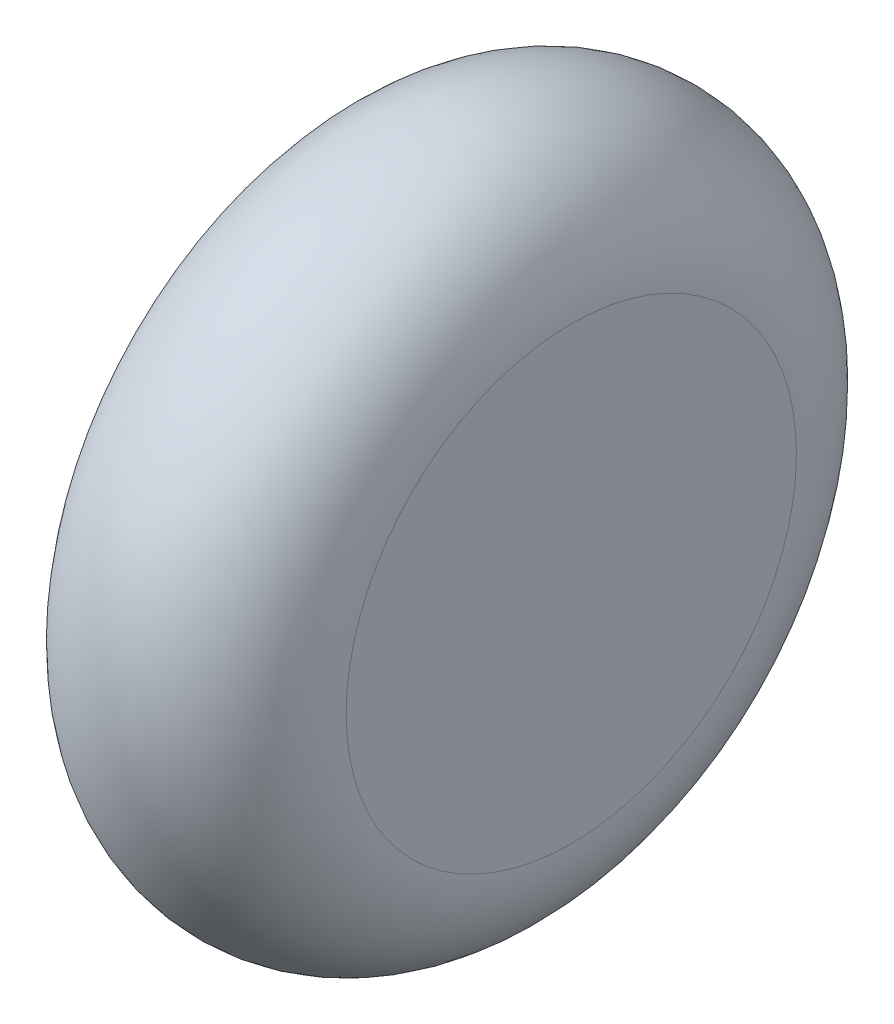
ISO-10303-21;
HEADER;
FILE_DESCRIPTION(('STEP AP214'),'2;1');
FILE_NAME('part.step','',(''),(''),'','','');
FILE_SCHEMA(('AUTOMOTIVE_DESIGN { 1 0 10303 214 1 1 1 1 }'));
ENDSEC;
DATA;
#1=APPLICATION_CONTEXT('core data for automotive mechanical design processes');
#2=APPLICATION_PROTOCOL_DEFINITION('international standard','automotive_design',2000,#1);
#3=PRODUCT_CONTEXT('',#1,'mechanical');
#4=PRODUCT('Part','Part','',(#3));
#5=PRODUCT_RELATED_PRODUCT_CATEGORY('part','',(#4));
#6=PRODUCT_DEFINITION_FORMATION('','',#4);
#7=PRODUCT_DEFINITION_CONTEXT('part definition',#1,'design');
#8=PRODUCT_DEFINITION('design','',#6,#7);
#9=PRODUCT_DEFINITION_SHAPE('','',#8);
#10=(LENGTH_UNIT() NAMED_UNIT(*) SI_UNIT(.MILLI.,.METRE.));
#11=(NAMED_UNIT(*) PLANE_ANGLE_UNIT() SI_UNIT($,.RADIAN.));
#12=(NAMED_UNIT(*) SI_UNIT($,.STERADIAN.) SOLID_ANGLE_UNIT());
#13=UNCERTAINTY_MEASURE_WITH_UNIT(LENGTH_MEASURE(1.E-05),#10,'distance_accuracy_value','');
#14=(GEOMETRIC_REPRESENTATION_CONTEXT(3) GLOBAL_UNCERTAINTY_ASSIGNED_CONTEXT((#13)) GLOBAL_UNIT_ASSIGNED_CONTEXT((#10,
#11,#12)) REPRESENTATION_CONTEXT('',''));
#15=CARTESIAN_POINT('',(0.,0.,0.));
#16=DIRECTION('',(0.,0.,1.));
#17=DIRECTION('',(1.,0.,0.));
#18=AXIS2_PLACEMENT_3D('',#15,#16,#17);
#19=CARTESIAN_POINT('',(-4.064,0.,0.));
#20=DIRECTION('',(1.,0.,0.));
#21=DIRECTION('',(0.,0.,-1.));
#22=AXIS2_PLACEMENT_3D('',#19,#20,#21);
#23=PLANE('',#22);
#24=CARTESIAN_POINT('',(-4.064,0.,0.));
#25=DIRECTION('',(1.,0.,0.));
#26=DIRECTION('',(0.,0.,-1.));
#27=AXIS2_PLACEMENT_3D('',#24,#25,#26);
#28=CIRCLE('',#27,7.366);
#29=CARTESIAN_POINT('',(-4.064,0.,-7.366));
#30=VERTEX_POINT('',#29);
#31=CARTESIAN_POINT('',(-4.064,0.,7.366));
#32=VERTEX_POINT('',#31);
#33=EDGE_CURVE('E28',#30,#32,#28,.T.);
#34=ORIENTED_EDGE('',*,*,#33,.F.);
#35=CARTESIAN_POINT('',(-4.064,0.,0.));
#36=DIRECTION('',(1.,0.,0.));
#37=DIRECTION('',(0.,0.,1.));
#38=AXIS2_PLACEMENT_3D('',#35,#36,#37);
#39=CIRCLE('',#38,7.366);
#40=EDGE_CURVE('E42',#32,#30,#39,.T.);
#41=ORIENTED_EDGE('',*,*,#40,.F.);
#42=EDGE_LOOP('',(#34,#41));
#43=FACE_BOUND('',#42,.T.);
#44=ADVANCED_FACE('F16',(#43),#23,.F.);
#45=CARTESIAN_POINT('',(4.064,0.,0.));
#46=DIRECTION('',(-1.,0.,0.));
#47=DIRECTION('',(0.,0.,1.));
#48=AXIS2_PLACEMENT_3D('',#45,#46,#47);
#49=PLANE('',#48);
#50=CARTESIAN_POINT('',(4.064,0.,0.));
#51=DIRECTION('',(-1.,0.,0.));
#52=DIRECTION('',(0.,0.,1.));
#53=AXIS2_PLACEMENT_3D('',#50,#51,#52);
#54=CIRCLE('',#53,7.366);
#55=CARTESIAN_POINT('',(4.064,0.,7.366));
#56=VERTEX_POINT('',#55);
#57=CARTESIAN_POINT('',(4.064,0.,-7.366));
#58=VERTEX_POINT('',#57);
#59=EDGE_CURVE('E11',#56,#58,#54,.T.);
#60=ORIENTED_EDGE('',*,*,#59,.F.);
#61=CARTESIAN_POINT('',(4.064,0.,0.));
#62=DIRECTION('',(-1.,0.,0.));
#63=DIRECTION('',(0.,0.,-1.));
#64=AXIS2_PLACEMENT_3D('',#61,#62,#63);
#65=CIRCLE('',#64,7.366);
#66=EDGE_CURVE('E33',#58,#56,#65,.T.);
#67=ORIENTED_EDGE('',*,*,#66,.F.);
#68=EDGE_LOOP('',(#60,#67));
#69=FACE_BOUND('',#68,.T.);
#70=ADVANCED_FACE('F82',(#69),#49,.F.);
#71=CARTESIAN_POINT('',(0.,0.,0.));
#72=DIRECTION('',(-1.,0.,0.));
#73=DIRECTION('',(0.,0.,1.));
#74=AXIS2_PLACEMENT_3D('',#71,#72,#73);
#75=TOROIDAL_SURFACE('',#74,7.366,4.064);
#76=ORIENTED_EDGE('',*,*,#40,.T.);
#77=ORIENTED_EDGE('',*,*,#33,.T.);
#78=EDGE_LOOP('',(#76,#77));
#79=FACE_BOUND('',#78,.T.);
#80=ORIENTED_EDGE('',*,*,#59,.T.);
#81=ORIENTED_EDGE('',*,*,#66,.T.);
#82=EDGE_LOOP('',(#80,#81));
#83=FACE_BOUND('',#82,.T.);
#84=ADVANCED_FACE('F45',(#79,#83),#75,.T.);
#85=CLOSED_SHELL('',(#44,#70,#84));
#86=MANIFOLD_SOLID_BREP('B1',#85);
#87=ADVANCED_BREP_SHAPE_REPRESENTATION('',(#18,#86),#14);
#88=SHAPE_DEFINITION_REPRESENTATION(#9,#87);
ENDSEC;
END-ISO-10303-21;
